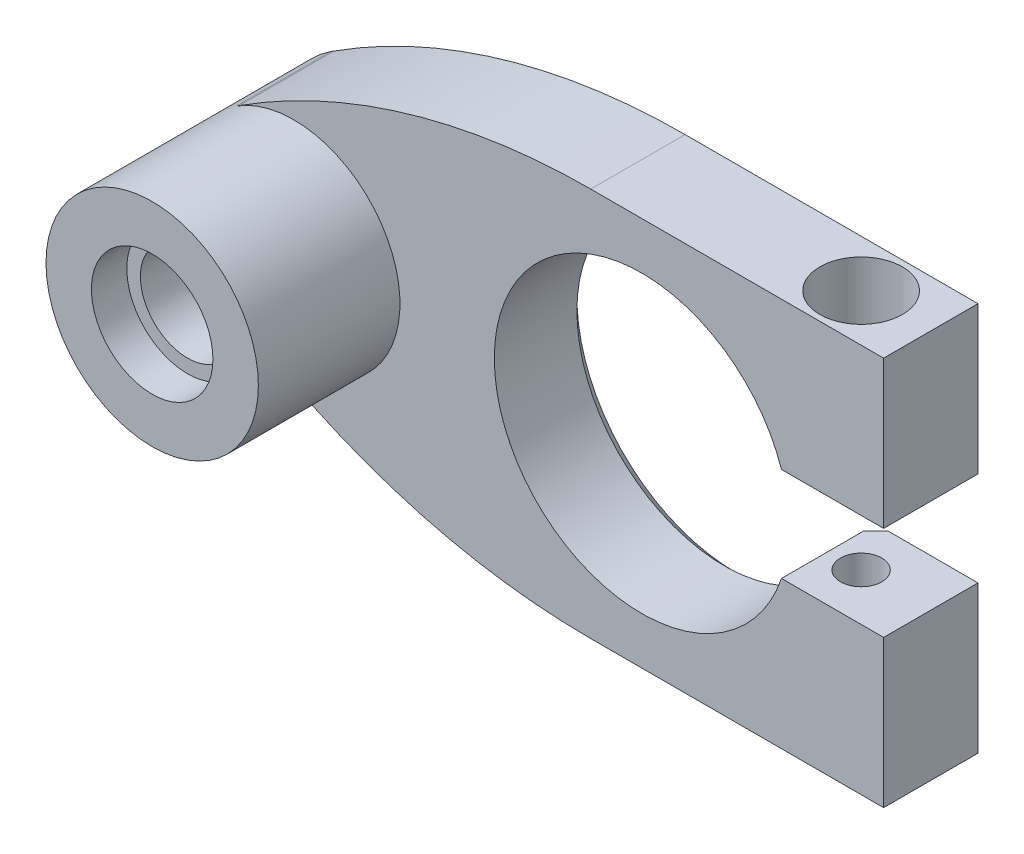
ISO-10303-21;
HEADER;
FILE_DESCRIPTION(('STEP AP214'),'2;1');
FILE_NAME('part.step','',(''),(''),'','','');
FILE_SCHEMA(('AUTOMOTIVE_DESIGN { 1 0 10303 214 1 1 1 1 }'));
ENDSEC;
DATA;
#1=APPLICATION_CONTEXT('core data for automotive mechanical design processes');
#2=APPLICATION_PROTOCOL_DEFINITION('international standard','automotive_design',2000,#1);
#3=PRODUCT_CONTEXT('',#1,'mechanical');
#4=PRODUCT('Part','Part','',(#3));
#5=PRODUCT_RELATED_PRODUCT_CATEGORY('part','',(#4));
#6=PRODUCT_DEFINITION_FORMATION('','',#4);
#7=PRODUCT_DEFINITION_CONTEXT('part definition',#1,'design');
#8=PRODUCT_DEFINITION('design','',#6,#7);
#9=PRODUCT_DEFINITION_SHAPE('','',#8);
#10=(LENGTH_UNIT() NAMED_UNIT(*) SI_UNIT(.MILLI.,.METRE.));
#11=(NAMED_UNIT(*) PLANE_ANGLE_UNIT() SI_UNIT($,.RADIAN.));
#12=(NAMED_UNIT(*) SI_UNIT($,.STERADIAN.) SOLID_ANGLE_UNIT());
#13=UNCERTAINTY_MEASURE_WITH_UNIT(LENGTH_MEASURE(1.E-05),#10,'distance_accuracy_value','');
#14=(GEOMETRIC_REPRESENTATION_CONTEXT(3) GLOBAL_UNCERTAINTY_ASSIGNED_CONTEXT((#13)) GLOBAL_UNIT_ASSIGNED_CONTEXT((#10,
#11,#12)) REPRESENTATION_CONTEXT('',''));
#15=CARTESIAN_POINT('',(0.,0.,0.));
#16=DIRECTION('',(0.,0.,1.));
#17=DIRECTION('',(1.,0.,0.));
#18=AXIS2_PLACEMENT_3D('',#15,#16,#17);
#19=CARTESIAN_POINT('',(14.592719282327,16.5,4.));
#20=DIRECTION('',(0.,-1.,0.));
#21=DIRECTION('',(0.,0.,-1.));
#22=AXIS2_PLACEMENT_3D('',#19,#20,#21);
#23=CYLINDRICAL_SURFACE('',#22,1.75);
#24=CARTESIAN_POINT('',(14.592719282327,4.,4.));
#25=DIRECTION('',(0.,1.,0.));
#26=DIRECTION('',(0.,0.,1.));
#27=AXIS2_PLACEMENT_3D('',#24,#25,#26);
#28=CIRCLE('',#27,1.75);
#29=CARTESIAN_POINT('',(14.592719282327,4.,5.75));
#30=VERTEX_POINT('',#29);
#31=EDGE_CURVE('E230',#30,#30,#28,.T.);
#32=ORIENTED_EDGE('',*,*,#31,.F.);
#33=EDGE_LOOP('',(#32));
#34=FACE_BOUND('',#33,.T.);
#35=CARTESIAN_POINT('',(14.592719282327,11.5,4.));
#36=DIRECTION('',(0.,1.,0.));
#37=DIRECTION('',(0.,0.,1.));
#38=AXIS2_PLACEMENT_3D('',#35,#36,#37);
#39=CIRCLE('',#38,1.75);
#40=CARTESIAN_POINT('',(14.592719282327,11.5,5.75));
#41=VERTEX_POINT('',#40);
#42=EDGE_CURVE('E210',#41,#41,#39,.F.);
#43=ORIENTED_EDGE('',*,*,#42,.F.);
#44=EDGE_LOOP('',(#43));
#45=FACE_BOUND('',#44,.T.);
#46=ADVANCED_FACE('F34',(#34,#45),#23,.F.);
#47=CARTESIAN_POINT('',(14.592719282327,-4.,4.));
#48=DIRECTION('',(0.,-1.,0.));
#49=DIRECTION('',(0.,0.,-1.));
#50=AXIS2_PLACEMENT_3D('',#47,#48,#49);
#51=CIRCLE('',#50,1.75);
#52=CARTESIAN_POINT('',(14.592719282327,-4.,2.25));
#53=VERTEX_POINT('',#52);
#54=EDGE_CURVE('E233',#53,#53,#51,.T.);
#55=ORIENTED_EDGE('',*,*,#54,.F.);
#56=EDGE_LOOP('',(#55));
#57=FACE_BOUND('',#56,.T.);
#58=CARTESIAN_POINT('',(14.592719282327,-9.5,4.));
#59=DIRECTION('',(0.,-1.,0.));
#60=DIRECTION('',(0.,0.,-1.));
#61=AXIS2_PLACEMENT_3D('',#58,#59,#60);
#62=CIRCLE('',#61,1.75);
#63=CARTESIAN_POINT('',(14.592719282327,-9.5,2.25));
#64=VERTEX_POINT('',#63);
#65=EDGE_CURVE('E222',#64,#64,#62,.F.);
#66=ORIENTED_EDGE('',*,*,#65,.F.);
#67=EDGE_LOOP('',(#66));
#68=FACE_BOUND('',#67,.T.);
#69=ADVANCED_FACE('F392',(#57,#68),#23,.F.);
#70=CARTESIAN_POINT('',(-29.5,0.,20.));
#71=DIRECTION('',(0.,0.,-1.));
#72=DIRECTION('',(-1.,0.,0.));
#73=AXIS2_PLACEMENT_3D('',#70,#71,#72);
#74=CYLINDRICAL_SURFACE('',#73,4.);
#75=CARTESIAN_POINT('',(-29.5,0.,3.));
#76=DIRECTION('',(0.,0.,1.));
#77=DIRECTION('',(1.,0.,0.));
#78=AXIS2_PLACEMENT_3D('',#75,#76,#77);
#79=CIRCLE('',#78,4.);
#80=CARTESIAN_POINT('',(-25.5,0.,3.));
#81=VERTEX_POINT('',#80);
#82=EDGE_CURVE('E239',#81,#81,#79,.T.);
#83=ORIENTED_EDGE('',*,*,#82,.F.);
#84=EDGE_LOOP('',(#83));
#85=FACE_BOUND('',#84,.T.);
#86=CARTESIAN_POINT('',(-29.5,0.,17.));
#87=DIRECTION('',(0.,0.,1.));
#88=DIRECTION('',(1.,0.,0.));
#89=AXIS2_PLACEMENT_3D('',#86,#87,#88);
#90=CIRCLE('',#89,4.);
#91=CARTESIAN_POINT('',(-25.5,0.,17.));
#92=VERTEX_POINT('',#91);
#93=EDGE_CURVE('E243',#92,#92,#90,.T.);
#94=ORIENTED_EDGE('',*,*,#93,.T.);
#95=EDGE_LOOP('',(#94));
#96=FACE_BOUND('',#95,.T.);
#97=ADVANCED_FACE('F398',(#85,#96),#74,.F.);
#98=CARTESIAN_POINT('',(-29.5,0.,20.));
#99=DIRECTION('',(0.,0.,1.));
#100=DIRECTION('',(1.,0.,0.));
#101=AXIS2_PLACEMENT_3D('',#98,#99,#100);
#102=PLANE('',#101);
#103=CARTESIAN_POINT('',(-29.5,0.,20.));
#104=DIRECTION('',(0.,0.,1.));
#105=DIRECTION('',(1.,0.,0.));
#106=AXIS2_PLACEMENT_3D('',#103,#104,#105);
#107=CIRCLE('',#106,5.15);
#108=CARTESIAN_POINT('',(-24.35,0.,20.));
#109=VERTEX_POINT('',#108);
#110=EDGE_CURVE('E244',#109,#109,#107,.T.);
#111=ORIENTED_EDGE('',*,*,#110,.F.);
#112=EDGE_LOOP('',(#111));
#113=FACE_BOUND('',#112,.T.);
#114=CARTESIAN_POINT('',(-29.5,0.,20.));
#115=DIRECTION('',(0.,0.,1.));
#116=DIRECTION('',(1.,0.,0.));
#117=AXIS2_PLACEMENT_3D('',#114,#115,#116);
#118=CIRCLE('',#117,9.00000000000001);
#119=CARTESIAN_POINT('',(-20.5,0.,20.));
#120=VERTEX_POINT('',#119);
#121=EDGE_CURVE('E269',#120,#120,#118,.T.);
#122=ORIENTED_EDGE('',*,*,#121,.T.);
#123=EDGE_LOOP('',(#122));
#124=FACE_BOUND('',#123,.T.);
#125=ADVANCED_FACE('F430',(#113,#124),#102,.T.);
#126=CARTESIAN_POINT('',(20.5,-4.,20.));
#127=DIRECTION('',(-1.,0.,0.));
#128=DIRECTION('',(0.,0.,1.));
#129=AXIS2_PLACEMENT_3D('',#126,#127,#128);
#130=PLANE('',#129);
#131=DIRECTION('',(0.,1.,0.));
#132=VECTOR('',#131,1.);
#133=CARTESIAN_POINT('',(20.5,-4.,8.));
#134=LINE('',#133,#132);
#135=CARTESIAN_POINT('',(20.5,-16.5,8.));
#136=VERTEX_POINT('',#135);
#137=CARTESIAN_POINT('',(20.5,-4.,8.));
#138=VERTEX_POINT('',#137);
#139=EDGE_CURVE('E253',#136,#138,#134,.T.);
#140=ORIENTED_EDGE('',*,*,#139,.F.);
#141=DIRECTION('',(0.,0.,-1.));
#142=VECTOR('',#141,1.);
#143=CARTESIAN_POINT('',(20.5,-16.5,20.));
#144=LINE('',#143,#142);
#145=CARTESIAN_POINT('',(20.5,-16.5,0.));
#146=VERTEX_POINT('',#145);
#147=EDGE_CURVE('E272',#136,#146,#144,.T.);
#148=ORIENTED_EDGE('',*,*,#147,.T.);
#149=DIRECTION('',(0.,1.,0.));
#150=VECTOR('',#149,1.);
#151=CARTESIAN_POINT('',(20.5,-4.,0.));
#152=LINE('',#151,#150);
#153=CARTESIAN_POINT('',(20.5,-4.,0.));
#154=VERTEX_POINT('',#153);
#155=EDGE_CURVE('E268',#146,#154,#152,.T.);
#156=ORIENTED_EDGE('',*,*,#155,.T.);
#157=DIRECTION('',(0.,0.,-1.));
#158=VECTOR('',#157,1.);
#159=CARTESIAN_POINT('',(20.5,-4.,20.));
#160=LINE('',#159,#158);
#161=EDGE_CURVE('E312',#138,#154,#160,.T.);
#162=ORIENTED_EDGE('',*,*,#161,.F.);
#163=EDGE_LOOP('',(#140,#148,#156,#162));
#164=FACE_BOUND('',#163,.T.);
#165=ADVANCED_FACE('F372',(#164),#130,.F.);
#166=CARTESIAN_POINT('',(20.5,-4.,20.));
#167=DIRECTION('',(0.,-1.,0.));
#168=DIRECTION('',(0.,0.,-1.));
#169=AXIS2_PLACEMENT_3D('',#166,#167,#168);
#170=PLANE('',#169);
#171=ORIENTED_EDGE('',*,*,#54,.T.);
#172=EDGE_LOOP('',(#171));
#173=FACE_BOUND('',#172,.T.);
#174=DIRECTION('',(-1.,0.,0.));
#175=VECTOR('',#174,1.);
#176=CARTESIAN_POINT('',(20.5,-4.,0.));
#177=LINE('',#176,#175);
#178=CARTESIAN_POINT('',(12.8937969582276,-4.,0.));
#179=VERTEX_POINT('',#178);
#180=EDGE_CURVE('E276',#154,#179,#177,.T.);
#181=ORIENTED_EDGE('',*,*,#180,.T.);
#182=CARTESIAN_POINT('',(12.8937969582276,-4.,0.));
#183=CARTESIAN_POINT('',(12.7189527197675,-4.,0.167019157332451));
#184=CARTESIAN_POINT('',(12.5439407976292,-4.,0.333862066094261));
#185=CARTESIAN_POINT('',(12.1935815723551,-4.,0.667195399455045));
#186=CARTESIAN_POINT('',(12.0182342691932,-4.,0.83368582402657));
#187=CARTESIAN_POINT('',(11.842719282327,-4.,1.00000000000001));
#188=B_SPLINE_CURVE_WITH_KNOTS('',3,(#182,#183,#184,#185,#186,#187),.UNSPECIFIED.,.F.,.F.,(4,2,
4),(0.,0.725390627077384,1.45078131064144),.UNSPECIFIED.);
#189=CARTESIAN_POINT('',(11.842719282327,-4.00000000000001,1.));
#190=VERTEX_POINT('',#189);
#191=EDGE_CURVE('E42',#179,#190,#188,.T.);
#192=ORIENTED_EDGE('',*,*,#191,.T.);
#193=DIRECTION('',(0.,0.,-1.));
#194=VECTOR('',#193,1.);
#195=CARTESIAN_POINT('',(11.842719282327,-4.00000000000001,20.));
#196=LINE('',#195,#194);
#197=CARTESIAN_POINT('',(11.842719282327,-4.,8.));
#198=VERTEX_POINT('',#197);
#199=EDGE_CURVE('E309',#198,#190,#196,.T.);
#200=ORIENTED_EDGE('',*,*,#199,.F.);
#201=DIRECTION('',(-1.,0.,0.));
#202=VECTOR('',#201,1.);
#203=CARTESIAN_POINT('',(20.5,-4.,8.));
#204=LINE('',#203,#202);
#205=EDGE_CURVE('E255',#138,#198,#204,.T.);
#206=ORIENTED_EDGE('',*,*,#205,.F.);
#207=ORIENTED_EDGE('',*,*,#161,.T.);
#208=EDGE_LOOP('',(#181,#192,#200,#206,#207));
#209=FACE_BOUND('',#208,.T.);
#210=ADVANCED_FACE('F367',(#173,#209),#170,.F.);
#211=CARTESIAN_POINT('',(0.,0.,20.));
#212=DIRECTION('',(0.,0.,-1.));
#213=DIRECTION('',(-1.,0.,0.));
#214=AXIS2_PLACEMENT_3D('',#211,#212,#213);
#215=CYLINDRICAL_SURFACE('',#214,12.5);
#216=ORIENTED_EDGE('',*,*,#199,.T.);
#217=CARTESIAN_POINT('',(0.,0.,1.));
#218=DIRECTION('',(0.,0.,1.));
#219=DIRECTION('',(1.,0.,0.));
#220=AXIS2_PLACEMENT_3D('',#217,#218,#219);
#221=CIRCLE('',#220,12.5);
#222=CARTESIAN_POINT('',(11.842719282327,4.,1.));
#223=VERTEX_POINT('',#222);
#224=EDGE_CURVE('E334',#190,#223,#221,.F.);
#225=ORIENTED_EDGE('',*,*,#224,.T.);
#226=DIRECTION('',(0.,0.,-1.));
#227=VECTOR('',#226,1.);
#228=CARTESIAN_POINT('',(11.842719282327,4.,20.));
#229=LINE('',#228,#227);
#230=CARTESIAN_POINT('',(11.842719282327,4.,8.));
#231=VERTEX_POINT('',#230);
#232=EDGE_CURVE('E307',#231,#223,#229,.T.);
#233=ORIENTED_EDGE('',*,*,#232,.F.);
#234=CARTESIAN_POINT('',(0.,0.,8.));
#235=DIRECTION('',(0.,0.,1.));
#236=DIRECTION('',(1.,0.,0.));
#237=AXIS2_PLACEMENT_3D('',#234,#235,#236);
#238=CIRCLE('',#237,12.5);
#239=EDGE_CURVE('E257',#198,#231,#238,.F.);
#240=ORIENTED_EDGE('',*,*,#239,.F.);
#241=EDGE_LOOP('',(#216,#225,#233,#240));
#242=FACE_BOUND('',#241,.T.);
#243=ADVANCED_FACE('F362',(#242),#215,.F.);
#244=CARTESIAN_POINT('',(20.5,4.,20.));
#245=DIRECTION('',(0.,1.,0.));
#246=DIRECTION('',(0.,0.,1.));
#247=AXIS2_PLACEMENT_3D('',#244,#245,#246);
#248=PLANE('',#247);
#249=ORIENTED_EDGE('',*,*,#31,.T.);
#250=EDGE_LOOP('',(#249));
#251=FACE_BOUND('',#250,.T.);
#252=ORIENTED_EDGE('',*,*,#232,.T.);
#253=CARTESIAN_POINT('',(11.842719282327,4.,1.));
#254=CARTESIAN_POINT('',(12.0182342691932,4.,0.83368582402657));
#255=CARTESIAN_POINT('',(12.1935815723551,4.,0.667195399455045));
#256=CARTESIAN_POINT('',(12.5439407976292,4.,0.333862066094261));
#257=CARTESIAN_POINT('',(12.7189527197675,4.,0.167019157332452));
#258=CARTESIAN_POINT('',(12.8937969582276,4.,0.));
#259=B_SPLINE_CURVE_WITH_KNOTS('',3,(#253,#254,#255,#256,#257,#258),.UNSPECIFIED.,.F.,.F.,(4,2,
4),(0.,0.725390683564053,1.45078131064144),.UNSPECIFIED.);
#260=CARTESIAN_POINT('',(12.8937969582276,4.,0.));
#261=VERTEX_POINT('',#260);
#262=EDGE_CURVE('E57',#223,#261,#259,.T.);
#263=ORIENTED_EDGE('',*,*,#262,.T.);
#264=DIRECTION('',(1.,0.,0.));
#265=VECTOR('',#264,1.);
#266=CARTESIAN_POINT('',(20.5,4.,0.));
#267=LINE('',#266,#265);
#268=CARTESIAN_POINT('',(20.5,4.,0.));
#269=VERTEX_POINT('',#268);
#270=EDGE_CURVE('E278',#261,#269,#267,.T.);
#271=ORIENTED_EDGE('',*,*,#270,.T.);
#272=DIRECTION('',(0.,0.,-1.));
#273=VECTOR('',#272,1.);
#274=CARTESIAN_POINT('',(20.5,4.,20.));
#275=LINE('',#274,#273);
#276=CARTESIAN_POINT('',(20.5,4.,8.));
#277=VERTEX_POINT('',#276);
#278=EDGE_CURVE('E304',#277,#269,#275,.T.);
#279=ORIENTED_EDGE('',*,*,#278,.F.);
#280=DIRECTION('',(1.,0.,0.));
#281=VECTOR('',#280,1.);
#282=CARTESIAN_POINT('',(20.5,4.,8.));
#283=LINE('',#282,#281);
#284=EDGE_CURVE('E259',#231,#277,#283,.T.);
#285=ORIENTED_EDGE('',*,*,#284,.F.);
#286=EDGE_LOOP('',(#252,#263,#271,#279,#285));
#287=FACE_BOUND('',#286,.T.);
#288=ADVANCED_FACE('F356',(#251,#287),#248,.F.);
#289=CARTESIAN_POINT('',(20.5,16.5,20.));
#290=DIRECTION('',(-1.,0.,0.));
#291=DIRECTION('',(0.,0.,1.));
#292=AXIS2_PLACEMENT_3D('',#289,#290,#291);
#293=PLANE('',#292);
#294=DIRECTION('',(0.,1.,0.));
#295=VECTOR('',#294,1.);
#296=CARTESIAN_POINT('',(20.5,16.5,8.));
#297=LINE('',#296,#295);
#298=CARTESIAN_POINT('',(20.5,16.5,8.));
#299=VERTEX_POINT('',#298);
#300=EDGE_CURVE('E261',#277,#299,#297,.T.);
#301=ORIENTED_EDGE('',*,*,#300,.F.);
#302=ORIENTED_EDGE('',*,*,#278,.T.);
#303=DIRECTION('',(0.,1.,0.));
#304=VECTOR('',#303,1.);
#305=CARTESIAN_POINT('',(20.5,16.5,0.));
#306=LINE('',#305,#304);
#307=CARTESIAN_POINT('',(20.5,16.5,0.));
#308=VERTEX_POINT('',#307);
#309=EDGE_CURVE('E280',#269,#308,#306,.T.);
#310=ORIENTED_EDGE('',*,*,#309,.T.);
#311=DIRECTION('',(0.,0.,-1.));
#312=VECTOR('',#311,1.);
#313=CARTESIAN_POINT('',(20.5,16.5,20.));
#314=LINE('',#313,#312);
#315=EDGE_CURVE('E302',#299,#308,#314,.T.);
#316=ORIENTED_EDGE('',*,*,#315,.F.);
#317=EDGE_LOOP('',(#301,#302,#310,#316));
#318=FACE_BOUND('',#317,.T.);
#319=ADVANCED_FACE('F361',(#318),#293,.F.);
#320=CARTESIAN_POINT('',(-20.5,16.5,20.));
#321=DIRECTION('',(0.,-1.,0.));
#322=DIRECTION('',(0.,0.,-1.));
#323=AXIS2_PLACEMENT_3D('',#320,#321,#322);
#324=PLANE('',#323);
#325=CARTESIAN_POINT('',(14.592719282327,16.5,4.));
#326=DIRECTION('',(0.,1.,0.));
#327=DIRECTION('',(0.,0.,1.));
#328=AXIS2_PLACEMENT_3D('',#325,#326,#327);
#329=CIRCLE('',#328,3.5);
#330=CARTESIAN_POINT('',(14.592719282327,16.5,7.5));
#331=VERTEX_POINT('',#330);
#332=EDGE_CURVE('E198',#331,#331,#329,.T.);
#333=ORIENTED_EDGE('',*,*,#332,.F.);
#334=EDGE_LOOP('',(#333));
#335=FACE_BOUND('',#334,.T.);
#336=DIRECTION('',(-1.,0.,0.));
#337=VECTOR('',#336,1.);
#338=CARTESIAN_POINT('',(-20.5,16.5,0.));
#339=LINE('',#338,#337);
#340=CARTESIAN_POINT('',(-4.32352941176473,16.5,0.));
#341=VERTEX_POINT('',#340);
#342=EDGE_CURVE('E283',#308,#341,#339,.T.);
#343=ORIENTED_EDGE('',*,*,#342,.T.);
#344=DIRECTION('',(0.,0.,-1.));
#345=VECTOR('',#344,1.);
#346=CARTESIAN_POINT('',(-4.32352941176473,16.5,20.));
#347=LINE('',#346,#345);
#348=CARTESIAN_POINT('',(-4.32352941176473,16.5,8.));
#349=VERTEX_POINT('',#348);
#350=EDGE_CURVE('E332',#341,#349,#347,.F.);
#351=ORIENTED_EDGE('',*,*,#350,.T.);
#352=DIRECTION('',(-1.,0.,0.));
#353=VECTOR('',#352,1.);
#354=CARTESIAN_POINT('',(-20.5,16.5,8.));
#355=LINE('',#354,#353);
#356=EDGE_CURVE('E263',#299,#349,#355,.T.);
#357=ORIENTED_EDGE('',*,*,#356,.F.);
#358=ORIENTED_EDGE('',*,*,#315,.T.);
#359=EDGE_LOOP('',(#343,#351,#357,#358));
#360=FACE_BOUND('',#359,.T.);
#361=ADVANCED_FACE('F450',(#335,#360),#324,.F.);
#362=CARTESIAN_POINT('',(-20.5,16.5,20.));
#363=DIRECTION('',(0.54140127388535,-0.840764331210191,0.));
#364=DIRECTION('',(0.840764331210191,0.54140127388535,0.));
#365=AXIS2_PLACEMENT_3D('',#362,#363,#364);
#366=PLANE('',#365);
#367=DIRECTION('',(-0.840764331210191,-0.54140127388535,0.));
#368=VECTOR('',#367,1.);
#369=CARTESIAN_POINT('',(-20.5,16.5,8.));
#370=LINE('',#369,#368);
#371=CARTESIAN_POINT('',(-34.100599475459,7.74203821656051,8.));
#372=VERTEX_POINT('',#371);
#373=CARTESIAN_POINT('',(-34.3726114649682,7.56687898089172,8.));
#374=VERTEX_POINT('',#373);
#375=EDGE_CURVE('E266',#372,#374,#370,.T.);
#376=ORIENTED_EDGE('',*,*,#375,.F.);
#377=DIRECTION('',(0.,0.,-1.));
#378=VECTOR('',#377,1.);
#379=CARTESIAN_POINT('',(-34.100599475459,7.74203821656051,20.));
#380=LINE('',#379,#378);
#381=CARTESIAN_POINT('',(-34.100599475459,7.74203821656051,0.));
#382=VERTEX_POINT('',#381);
#383=EDGE_CURVE('E329',#372,#382,#380,.T.);
#384=ORIENTED_EDGE('',*,*,#383,.T.);
#385=DIRECTION('',(-0.840764331210191,-0.54140127388535,0.));
#386=VECTOR('',#385,1.);
#387=CARTESIAN_POINT('',(-20.5,16.5,0.));
#388=LINE('',#387,#386);
#389=CARTESIAN_POINT('',(-34.3726114649682,7.56687898089172,0.));
#390=VERTEX_POINT('',#389);
#391=EDGE_CURVE('E286',#382,#390,#388,.T.);
#392=ORIENTED_EDGE('',*,*,#391,.T.);
#393=DIRECTION('',(0.,0.,-1.));
#394=VECTOR('',#393,1.);
#395=CARTESIAN_POINT('',(-34.3726114649682,7.56687898089172,20.));
#396=LINE('',#395,#394);
#397=EDGE_CURVE('E299',#374,#390,#396,.T.);
#398=ORIENTED_EDGE('',*,*,#397,.F.);
#399=EDGE_LOOP('',(#376,#384,#392,#398));
#400=FACE_BOUND('',#399,.T.);
#401=ADVANCED_FACE('F444',(#400),#366,.F.);
#402=CARTESIAN_POINT('',(-20.5,-16.5,20.));
#403=DIRECTION('',(0.54140127388535,0.840764331210191,0.));
#404=DIRECTION('',(-0.840764331210191,0.54140127388535,0.));
#405=AXIS2_PLACEMENT_3D('',#402,#403,#404);
#406=PLANE('',#405);
#407=DIRECTION('',(0.840764331210191,-0.54140127388535,0.));
#408=VECTOR('',#407,1.);
#409=CARTESIAN_POINT('',(-20.5,-16.5,0.));
#410=LINE('',#409,#408);
#411=CARTESIAN_POINT('',(-34.3726114649682,-7.56687898089172,0.));
#412=VERTEX_POINT('',#411);
#413=CARTESIAN_POINT('',(-34.100599475459,-7.74203821656051,0.));
#414=VERTEX_POINT('',#413);
#415=EDGE_CURVE('E291',#412,#414,#410,.T.);
#416=ORIENTED_EDGE('',*,*,#415,.T.);
#417=DIRECTION('',(0.,0.,-1.));
#418=VECTOR('',#417,1.);
#419=CARTESIAN_POINT('',(-34.100599475459,-7.74203821656051,20.));
#420=LINE('',#419,#418);
#421=CARTESIAN_POINT('',(-34.100599475459,-7.74203821656051,8.));
#422=VERTEX_POINT('',#421);
#423=EDGE_CURVE('E323',#414,#422,#420,.F.);
#424=ORIENTED_EDGE('',*,*,#423,.T.);
#425=DIRECTION('',(0.840764331210191,-0.54140127388535,0.));
#426=VECTOR('',#425,1.);
#427=CARTESIAN_POINT('',(-20.5,-16.5,8.));
#428=LINE('',#427,#426);
#429=CARTESIAN_POINT('',(-34.3726114649682,-7.56687898089172,8.));
#430=VERTEX_POINT('',#429);
#431=EDGE_CURVE('E250',#430,#422,#428,.T.);
#432=ORIENTED_EDGE('',*,*,#431,.F.);
#433=DIRECTION('',(0.,0.,-1.));
#434=VECTOR('',#433,1.);
#435=CARTESIAN_POINT('',(-34.3726114649682,-7.56687898089172,20.));
#436=LINE('',#435,#434);
#437=EDGE_CURVE('E297',#430,#412,#436,.T.);
#438=ORIENTED_EDGE('',*,*,#437,.T.);
#439=EDGE_LOOP('',(#416,#424,#432,#438));
#440=FACE_BOUND('',#439,.T.);
#441=ADVANCED_FACE('F440',(#440),#406,.F.);
#442=CARTESIAN_POINT('',(-20.5,-16.5,20.));
#443=DIRECTION('',(0.,1.,0.));
#444=DIRECTION('',(0.,0.,1.));
#445=AXIS2_PLACEMENT_3D('',#442,#443,#444);
#446=PLANE('',#445);
#447=DIRECTION('',(-0.866025403784438,0.,-0.500000000000001));
#448=VECTOR('',#447,1.);
#449=CARTESIAN_POINT('',(14.592719282327,-16.5,7.2331615074619));
#450=LINE('',#449,#448);
#451=CARTESIAN_POINT('',(14.592719282327,-16.5,7.2331615074619));
#452=VERTEX_POINT('',#451);
#453=CARTESIAN_POINT('',(11.792719282327,-16.5,5.61658075373095));
#454=VERTEX_POINT('',#453);
#455=EDGE_CURVE('E209',#452,#454,#450,.T.);
#456=ORIENTED_EDGE('',*,*,#455,.F.);
#457=DIRECTION('',(-0.866025403784439,0.,0.499999999999999));
#458=VECTOR('',#457,1.);
#459=CARTESIAN_POINT('',(17.392719282327,-16.5,5.61658075373095));
#460=LINE('',#459,#458);
#461=CARTESIAN_POINT('',(17.392719282327,-16.5,5.61658075373095));
#462=VERTEX_POINT('',#461);
#463=EDGE_CURVE('E173',#462,#452,#460,.T.);
#464=ORIENTED_EDGE('',*,*,#463,.F.);
#465=DIRECTION('',(0.,0.,1.));
#466=VECTOR('',#465,1.);
#467=CARTESIAN_POINT('',(17.392719282327,-16.5,2.38341924626904));
#468=LINE('',#467,#466);
#469=CARTESIAN_POINT('',(17.392719282327,-16.5,2.38341924626904));
#470=VERTEX_POINT('',#469);
#471=EDGE_CURVE('E192',#470,#462,#468,.T.);
#472=ORIENTED_EDGE('',*,*,#471,.F.);
#473=DIRECTION('',(0.866025403784438,0.,0.5));
#474=VECTOR('',#473,1.);
#475=CARTESIAN_POINT('',(14.592719282327,-16.5,0.766838492538091));
#476=LINE('',#475,#474);
#477=CARTESIAN_POINT('',(14.592719282327,-16.5,0.766838492538091));
#478=VERTEX_POINT('',#477);
#479=EDGE_CURVE('E195',#478,#470,#476,.T.);
#480=ORIENTED_EDGE('',*,*,#479,.F.);
#481=DIRECTION('',(0.866025403784439,0.,-0.499999999999999));
#482=VECTOR('',#481,1.);
#483=CARTESIAN_POINT('',(11.792719282327,-16.5,2.38341924626904));
#484=LINE('',#483,#482);
#485=CARTESIAN_POINT('',(11.792719282327,-16.5,2.38341924626904));
#486=VERTEX_POINT('',#485);
#487=EDGE_CURVE('E215',#486,#478,#484,.T.);
#488=ORIENTED_EDGE('',*,*,#487,.F.);
#489=DIRECTION('',(0.,0.,-1.));
#490=VECTOR('',#489,1.);
#491=CARTESIAN_POINT('',(11.792719282327,-16.5,5.61658075373095));
#492=LINE('',#491,#490);
#493=EDGE_CURVE('E212',#454,#486,#492,.T.);
#494=ORIENTED_EDGE('',*,*,#493,.F.);
#495=EDGE_LOOP('',(#456,#464,#472,#480,#488,#494));
#496=FACE_BOUND('',#495,.T.);
#497=DIRECTION('',(1.,0.,0.));
#498=VECTOR('',#497,1.);
#499=CARTESIAN_POINT('',(-20.5,-16.5,8.));
#500=LINE('',#499,#498);
#501=CARTESIAN_POINT('',(-4.32352941176472,-16.5,8.));
#502=VERTEX_POINT('',#501);
#503=EDGE_CURVE('E314',#502,#136,#500,.T.);
#504=ORIENTED_EDGE('',*,*,#503,.F.);
#505=DIRECTION('',(0.,0.,-1.));
#506=VECTOR('',#505,1.);
#507=CARTESIAN_POINT('',(-4.32352941176472,-16.5,20.));
#508=LINE('',#507,#506);
#509=CARTESIAN_POINT('',(-4.32352941176473,-16.5,0.));
#510=VERTEX_POINT('',#509);
#511=EDGE_CURVE('E316',#502,#510,#508,.T.);
#512=ORIENTED_EDGE('',*,*,#511,.T.);
#513=DIRECTION('',(1.,0.,0.));
#514=VECTOR('',#513,1.);
#515=CARTESIAN_POINT('',(-20.5,-16.5,0.));
#516=LINE('',#515,#514);
#517=EDGE_CURVE('E273',#510,#146,#516,.T.);
#518=ORIENTED_EDGE('',*,*,#517,.T.);
#519=ORIENTED_EDGE('',*,*,#147,.F.);
#520=EDGE_LOOP('',(#504,#512,#518,#519));
#521=FACE_BOUND('',#520,.T.);
#522=ADVANCED_FACE('F437',(#496,#521),#446,.F.);
#523=CARTESIAN_POINT('',(-29.5,0.,0.));
#524=DIRECTION('',(0.,0.,1.));
#525=DIRECTION('',(1.,0.,0.));
#526=AXIS2_PLACEMENT_3D('',#523,#524,#525);
#527=PLANE('',#526);
#528=CARTESIAN_POINT('',(-29.5,0.,0.));
#529=DIRECTION('',(0.,0.,1.));
#530=DIRECTION('',(1.,0.,0.));
#531=AXIS2_PLACEMENT_3D('',#528,#529,#530);
#532=CIRCLE('',#531,6.14999999999999);
#533=CARTESIAN_POINT('',(-23.35,0.,0.));
#534=VERTEX_POINT('',#533);
#535=EDGE_CURVE('E351',#534,#534,#532,.T.);
#536=ORIENTED_EDGE('',*,*,#535,.T.);
#537=EDGE_LOOP('',(#536));
#538=FACE_BOUND('',#537,.T.);
#539=ORIENTED_EDGE('',*,*,#270,.F.);
#540=CARTESIAN_POINT('',(0.,0.,0.));
#541=DIRECTION('',(0.,0.,1.));
#542=DIRECTION('',(1.,0.,0.));
#543=AXIS2_PLACEMENT_3D('',#540,#541,#542);
#544=CIRCLE('',#543,13.5);
#545=EDGE_CURVE('E49',#261,#179,#544,.T.);
#546=ORIENTED_EDGE('',*,*,#545,.T.);
#547=ORIENTED_EDGE('',*,*,#180,.F.);
#548=ORIENTED_EDGE('',*,*,#155,.F.);
#549=ORIENTED_EDGE('',*,*,#517,.F.);
#550=CARTESIAN_POINT('',(-4.32352941176472,38.5,0.));
#551=DIRECTION('',(0.,0.,1.));
#552=DIRECTION('',(1.,0.,0.));
#553=AXIS2_PLACEMENT_3D('',#550,#551,#552);
#554=CIRCLE('',#553,55.);
#555=EDGE_CURVE('E321',#510,#414,#554,.F.);
#556=ORIENTED_EDGE('',*,*,#555,.T.);
#557=ORIENTED_EDGE('',*,*,#415,.F.);
#558=CARTESIAN_POINT('',(-29.5,0.,0.));
#559=DIRECTION('',(0.,0.,1.));
#560=DIRECTION('',(1.,0.,0.));
#561=AXIS2_PLACEMENT_3D('',#558,#559,#560);
#562=CIRCLE('',#561,9.00000000000001);
#563=EDGE_CURVE('E288',#390,#412,#562,.T.);
#564=ORIENTED_EDGE('',*,*,#563,.F.);
#565=ORIENTED_EDGE('',*,*,#391,.F.);
#566=CARTESIAN_POINT('',(-4.32352941176473,-38.5,0.));
#567=DIRECTION('',(0.,0.,1.));
#568=DIRECTION('',(1.,0.,0.));
#569=AXIS2_PLACEMENT_3D('',#566,#567,#568);
#570=CIRCLE('',#569,55.);
#571=EDGE_CURVE('E319',#382,#341,#570,.F.);
#572=ORIENTED_EDGE('',*,*,#571,.T.);
#573=ORIENTED_EDGE('',*,*,#342,.F.);
#574=ORIENTED_EDGE('',*,*,#309,.F.);
#575=EDGE_LOOP('',(#539,#546,#547,#548,#549,#556,#557,#564,#565,#572,#573,#574));
#576=FACE_BOUND('',#575,.T.);
#577=ADVANCED_FACE('F381',(#538,#576),#527,.F.);
#578=CARTESIAN_POINT('',(-29.5,0.,20.));
#579=DIRECTION('',(0.,0.,-1.));
#580=DIRECTION('',(-1.,0.,0.));
#581=AXIS2_PLACEMENT_3D('',#578,#579,#580);
#582=CYLINDRICAL_SURFACE('',#581,9.00000000000001);
#583=CARTESIAN_POINT('',(-29.5,0.,8.));
#584=DIRECTION('',(0.,0.,1.));
#585=DIRECTION('',(1.,0.,0.));
#586=AXIS2_PLACEMENT_3D('',#583,#584,#585);
#587=CIRCLE('',#586,9.);
#588=EDGE_CURVE('E247',#430,#374,#587,.T.);
#589=ORIENTED_EDGE('',*,*,#588,.T.);
#590=ORIENTED_EDGE('',*,*,#397,.T.);
#591=ORIENTED_EDGE('',*,*,#563,.T.);
#592=ORIENTED_EDGE('',*,*,#437,.F.);
#593=EDGE_LOOP('',(#589,#590,#591,#592));
#594=FACE_BOUND('',#593,.T.);
#595=ORIENTED_EDGE('',*,*,#121,.F.);
#596=EDGE_LOOP('',(#595));
#597=FACE_BOUND('',#596,.T.);
#598=ADVANCED_FACE('F426',(#594,#597),#582,.T.);
#599=CARTESIAN_POINT('',(-9.,0.,8.));
#600=DIRECTION('',(0.,0.,1.));
#601=DIRECTION('',(1.,0.,0.));
#602=AXIS2_PLACEMENT_3D('',#599,#600,#601);
#603=PLANE('',#602);
#604=ORIENTED_EDGE('',*,*,#431,.T.);
#605=CARTESIAN_POINT('',(-4.32352941176472,38.5,8.));
#606=DIRECTION('',(0.,0.,1.));
#607=DIRECTION('',(1.,0.,0.));
#608=AXIS2_PLACEMENT_3D('',#605,#606,#607);
#609=CIRCLE('',#608,55.);
#610=EDGE_CURVE('E327',#422,#502,#609,.T.);
#611=ORIENTED_EDGE('',*,*,#610,.T.);
#612=ORIENTED_EDGE('',*,*,#503,.T.);
#613=ORIENTED_EDGE('',*,*,#139,.T.);
#614=ORIENTED_EDGE('',*,*,#205,.T.);
#615=ORIENTED_EDGE('',*,*,#239,.T.);
#616=ORIENTED_EDGE('',*,*,#284,.T.);
#617=ORIENTED_EDGE('',*,*,#300,.T.);
#618=ORIENTED_EDGE('',*,*,#356,.T.);
#619=CARTESIAN_POINT('',(-4.32352941176473,-38.5,8.));
#620=DIRECTION('',(0.,0.,1.));
#621=DIRECTION('',(1.,0.,0.));
#622=AXIS2_PLACEMENT_3D('',#619,#620,#621);
#623=CIRCLE('',#622,55.);
#624=EDGE_CURVE('E325',#349,#372,#623,.T.);
#625=ORIENTED_EDGE('',*,*,#624,.T.);
#626=ORIENTED_EDGE('',*,*,#375,.T.);
#627=ORIENTED_EDGE('',*,*,#588,.F.);
#628=EDGE_LOOP('',(#604,#611,#612,#613,#614,#615,#616,#617,#618,#625,#626,#627));
#629=FACE_BOUND('',#628,.T.);
#630=ADVANCED_FACE('F422',(#629),#603,.T.);
#631=CARTESIAN_POINT('',(-4.32352941176472,38.5,20.));
#632=DIRECTION('',(0.,0.,-1.));
#633=DIRECTION('',(-1.,0.,0.));
#634=AXIS2_PLACEMENT_3D('',#631,#632,#633);
#635=CYLINDRICAL_SURFACE('',#634,55.);
#636=ORIENTED_EDGE('',*,*,#610,.F.);
#637=ORIENTED_EDGE('',*,*,#423,.F.);
#638=ORIENTED_EDGE('',*,*,#555,.F.);
#639=ORIENTED_EDGE('',*,*,#511,.F.);
#640=EDGE_LOOP('',(#636,#637,#638,#639));
#641=FACE_BOUND('',#640,.T.);
#642=ADVANCED_FACE('F425',(#641),#635,.T.);
#643=CARTESIAN_POINT('',(-4.32352941176473,-38.5,20.));
#644=DIRECTION('',(0.,0.,-1.));
#645=DIRECTION('',(-1.,0.,0.));
#646=AXIS2_PLACEMENT_3D('',#643,#644,#645);
#647=CYLINDRICAL_SURFACE('',#646,55.);
#648=ORIENTED_EDGE('',*,*,#624,.F.);
#649=ORIENTED_EDGE('',*,*,#350,.F.);
#650=ORIENTED_EDGE('',*,*,#571,.F.);
#651=ORIENTED_EDGE('',*,*,#383,.F.);
#652=EDGE_LOOP('',(#648,#649,#650,#651));
#653=FACE_BOUND('',#652,.T.);
#654=ADVANCED_FACE('F420',(#653),#647,.T.);
#655=CARTESIAN_POINT('',(-29.5,0.,17.));
#656=DIRECTION('',(0.,0.,1.));
#657=DIRECTION('',(1.,0.,0.));
#658=AXIS2_PLACEMENT_3D('',#655,#656,#657);
#659=CYLINDRICAL_SURFACE('',#658,5.15);
#660=CARTESIAN_POINT('',(-29.5,0.,17.));
#661=DIRECTION('',(0.,0.,1.));
#662=DIRECTION('',(1.,0.,0.));
#663=AXIS2_PLACEMENT_3D('',#660,#661,#662);
#664=CIRCLE('',#663,5.15);
#665=CARTESIAN_POINT('',(-24.35,0.,17.));
#666=VERTEX_POINT('',#665);
#667=EDGE_CURVE('E240',#666,#666,#664,.T.);
#668=ORIENTED_EDGE('',*,*,#667,.F.);
#669=EDGE_LOOP('',(#668));
#670=FACE_BOUND('',#669,.T.);
#671=ORIENTED_EDGE('',*,*,#110,.T.);
#672=EDGE_LOOP('',(#671));
#673=FACE_BOUND('',#672,.T.);
#674=ADVANCED_FACE('F416',(#670,#673),#659,.F.);
#675=CARTESIAN_POINT('',(-29.5,0.,17.));
#676=DIRECTION('',(0.,0.,1.));
#677=DIRECTION('',(1.,0.,0.));
#678=AXIS2_PLACEMENT_3D('',#675,#676,#677);
#679=PLANE('',#678);
#680=ORIENTED_EDGE('',*,*,#93,.F.);
#681=EDGE_LOOP('',(#680));
#682=FACE_BOUND('',#681,.T.);
#683=ORIENTED_EDGE('',*,*,#667,.T.);
#684=EDGE_LOOP('',(#683));
#685=FACE_BOUND('',#684,.T.);
#686=ADVANCED_FACE('F412',(#682,#685),#679,.T.);
#687=CARTESIAN_POINT('',(-29.5,0.,3.));
#688=DIRECTION('',(0.,0.,-1.));
#689=DIRECTION('',(-1.,0.,0.));
#690=AXIS2_PLACEMENT_3D('',#687,#688,#689);
#691=CYLINDRICAL_SURFACE('',#690,5.15);
#692=CARTESIAN_POINT('',(-29.5,0.,0.999999999999995));
#693=DIRECTION('',(0.,0.,1.));
#694=DIRECTION('',(1.,0.,0.));
#695=AXIS2_PLACEMENT_3D('',#692,#693,#694);
#696=CIRCLE('',#695,5.15);
#697=CARTESIAN_POINT('',(-24.35,0.,0.999999999999995));
#698=VERTEX_POINT('',#697);
#699=EDGE_CURVE('E12',#698,#698,#696,.F.);
#700=ORIENTED_EDGE('',*,*,#699,.T.);
#701=EDGE_LOOP('',(#700));
#702=FACE_BOUND('',#701,.T.);
#703=CARTESIAN_POINT('',(-29.5,0.,3.));
#704=DIRECTION('',(0.,0.,1.));
#705=DIRECTION('',(1.,0.,0.));
#706=AXIS2_PLACEMENT_3D('',#703,#704,#705);
#707=CIRCLE('',#706,5.15);
#708=CARTESIAN_POINT('',(-24.35,0.,3.));
#709=VERTEX_POINT('',#708);
#710=EDGE_CURVE('E236',#709,#709,#707,.T.);
#711=ORIENTED_EDGE('',*,*,#710,.T.);
#712=EDGE_LOOP('',(#711));
#713=FACE_BOUND('',#712,.T.);
#714=ADVANCED_FACE('F408',(#702,#713),#691,.F.);
#715=CARTESIAN_POINT('',(-29.5,0.,3.));
#716=DIRECTION('',(0.,0.,1.));
#717=DIRECTION('',(1.,0.,0.));
#718=AXIS2_PLACEMENT_3D('',#715,#716,#717);
#719=PLANE('',#718);
#720=ORIENTED_EDGE('',*,*,#82,.T.);
#721=EDGE_LOOP('',(#720));
#722=FACE_BOUND('',#721,.T.);
#723=ORIENTED_EDGE('',*,*,#710,.F.);
#724=EDGE_LOOP('',(#723));
#725=FACE_BOUND('',#724,.T.);
#726=ADVANCED_FACE('F405',(#722,#725),#719,.F.);
#727=CARTESIAN_POINT('',(0.,-9.5,0.));
#728=DIRECTION('',(0.,-1.,0.));
#729=DIRECTION('',(0.,0.,-1.));
#730=AXIS2_PLACEMENT_3D('',#727,#728,#729);
#731=PLANE('',#730);
#732=DIRECTION('',(-0.866025403784439,0.,0.499999999999999));
#733=VECTOR('',#732,1.);
#734=CARTESIAN_POINT('',(17.392719282327,-9.5,5.61658075373095));
#735=LINE('',#734,#733);
#736=CARTESIAN_POINT('',(17.392719282327,-9.5,5.61658075373095));
#737=VERTEX_POINT('',#736);
#738=CARTESIAN_POINT('',(14.592719282327,-9.5,7.2331615074619));
#739=VERTEX_POINT('',#738);
#740=EDGE_CURVE('E170',#737,#739,#735,.T.);
#741=ORIENTED_EDGE('',*,*,#740,.T.);
#742=DIRECTION('',(-0.866025403784438,0.,-0.500000000000001));
#743=VECTOR('',#742,1.);
#744=CARTESIAN_POINT('',(14.592719282327,-9.5,7.2331615074619));
#745=LINE('',#744,#743);
#746=CARTESIAN_POINT('',(11.792719282327,-9.5,5.61658075373095));
#747=VERTEX_POINT('',#746);
#748=EDGE_CURVE('E181',#739,#747,#745,.T.);
#749=ORIENTED_EDGE('',*,*,#748,.T.);
#750=DIRECTION('',(0.,0.,-1.));
#751=VECTOR('',#750,1.);
#752=CARTESIAN_POINT('',(11.792719282327,-9.5,5.61658075373095));
#753=LINE('',#752,#751);
#754=CARTESIAN_POINT('',(11.792719282327,-9.5,2.38341924626904));
#755=VERTEX_POINT('',#754);
#756=EDGE_CURVE('E186',#747,#755,#753,.T.);
#757=ORIENTED_EDGE('',*,*,#756,.T.);
#758=DIRECTION('',(0.866025403784439,0.,-0.499999999999999));
#759=VECTOR('',#758,1.);
#760=CARTESIAN_POINT('',(11.792719282327,-9.5,2.38341924626904));
#761=LINE('',#760,#759);
#762=CARTESIAN_POINT('',(14.592719282327,-9.5,0.766838492538091));
#763=VERTEX_POINT('',#762);
#764=EDGE_CURVE('E202',#755,#763,#761,.T.);
#765=ORIENTED_EDGE('',*,*,#764,.T.);
#766=DIRECTION('',(0.866025403784438,0.,0.5));
#767=VECTOR('',#766,1.);
#768=CARTESIAN_POINT('',(14.592719282327,-9.5,0.766838492538091));
#769=LINE('',#768,#767);
#770=CARTESIAN_POINT('',(17.392719282327,-9.5,2.38341924626904));
#771=VERTEX_POINT('',#770);
#772=EDGE_CURVE('E205',#763,#771,#769,.T.);
#773=ORIENTED_EDGE('',*,*,#772,.T.);
#774=DIRECTION('',(0.,0.,1.));
#775=VECTOR('',#774,1.);
#776=CARTESIAN_POINT('',(17.392719282327,-9.5,2.38341924626904));
#777=LINE('',#776,#775);
#778=EDGE_CURVE('E178',#771,#737,#777,.T.);
#779=ORIENTED_EDGE('',*,*,#778,.T.);
#780=EDGE_LOOP('',(#741,#749,#757,#765,#773,#779));
#781=FACE_BOUND('',#780,.T.);
#782=ORIENTED_EDGE('',*,*,#65,.T.);
#783=EDGE_LOOP('',(#782));
#784=FACE_BOUND('',#783,.T.);
#785=ADVANCED_FACE('F188',(#781,#784),#731,.T.);
#786=CARTESIAN_POINT('',(17.392719282327,-9.5,5.61658075373095));
#787=DIRECTION('',(0.499999999999999,0.,0.866025403784439));
#788=DIRECTION('',(0.866025403784439,0.,-0.499999999999999));
#789=AXIS2_PLACEMENT_3D('',#786,#787,#788);
#790=PLANE('',#789);
#791=ORIENTED_EDGE('',*,*,#463,.T.);
#792=DIRECTION('',(0.,-1.,0.));
#793=VECTOR('',#792,1.);
#794=CARTESIAN_POINT('',(14.592719282327,-9.5,7.2331615074619));
#795=LINE('',#794,#793);
#796=EDGE_CURVE('E166',#739,#452,#795,.T.);
#797=ORIENTED_EDGE('',*,*,#796,.F.);
#798=ORIENTED_EDGE('',*,*,#740,.F.);
#799=DIRECTION('',(0.,-1.,0.));
#800=VECTOR('',#799,1.);
#801=CARTESIAN_POINT('',(17.392719282327,-9.5,5.61658075373095));
#802=LINE('',#801,#800);
#803=EDGE_CURVE('E220',#737,#462,#802,.T.);
#804=ORIENTED_EDGE('',*,*,#803,.T.);
#805=EDGE_LOOP('',(#791,#797,#798,#804));
#806=FACE_BOUND('',#805,.T.);
#807=ADVANCED_FACE('F168',(#806),#790,.F.);
#808=CARTESIAN_POINT('',(17.392719282327,-9.5,2.38341924626904));
#809=DIRECTION('',(1.,0.,0.));
#810=DIRECTION('',(0.,0.,-1.));
#811=AXIS2_PLACEMENT_3D('',#808,#809,#810);
#812=PLANE('',#811);
#813=ORIENTED_EDGE('',*,*,#471,.T.);
#814=ORIENTED_EDGE('',*,*,#803,.F.);
#815=ORIENTED_EDGE('',*,*,#778,.F.);
#816=DIRECTION('',(0.,-1.,0.));
#817=VECTOR('',#816,1.);
#818=CARTESIAN_POINT('',(17.392719282327,-9.5,2.38341924626904));
#819=LINE('',#818,#817);
#820=EDGE_CURVE('E223',#771,#470,#819,.T.);
#821=ORIENTED_EDGE('',*,*,#820,.T.);
#822=EDGE_LOOP('',(#813,#814,#815,#821));
#823=FACE_BOUND('',#822,.T.);
#824=ADVANCED_FACE('F621',(#823),#812,.F.);
#825=CARTESIAN_POINT('',(14.592719282327,-9.5,0.766838492538091));
#826=DIRECTION('',(0.5,0.,-0.866025403784438));
#827=DIRECTION('',(-0.866025403784439,0.,-0.5));
#828=AXIS2_PLACEMENT_3D('',#825,#826,#827);
#829=PLANE('',#828);
#830=ORIENTED_EDGE('',*,*,#479,.T.);
#831=ORIENTED_EDGE('',*,*,#820,.F.);
#832=ORIENTED_EDGE('',*,*,#772,.F.);
#833=DIRECTION('',(0.,-1.,0.));
#834=VECTOR('',#833,1.);
#835=CARTESIAN_POINT('',(14.592719282327,-9.5,0.766838492538091));
#836=LINE('',#835,#834);
#837=EDGE_CURVE('E225',#763,#478,#836,.T.);
#838=ORIENTED_EDGE('',*,*,#837,.T.);
#839=EDGE_LOOP('',(#830,#831,#832,#838));
#840=FACE_BOUND('',#839,.T.);
#841=ADVANCED_FACE('F629',(#840),#829,.F.);
#842=CARTESIAN_POINT('',(11.792719282327,-9.5,2.38341924626904));
#843=DIRECTION('',(-0.499999999999999,0.,-0.866025403784439));
#844=DIRECTION('',(-0.866025403784439,0.,0.499999999999999));
#845=AXIS2_PLACEMENT_3D('',#842,#843,#844);
#846=PLANE('',#845);
#847=ORIENTED_EDGE('',*,*,#487,.T.);
#848=ORIENTED_EDGE('',*,*,#837,.F.);
#849=ORIENTED_EDGE('',*,*,#764,.F.);
#850=DIRECTION('',(0.,-1.,0.));
#851=VECTOR('',#850,1.);
#852=CARTESIAN_POINT('',(11.792719282327,-9.5,2.38341924626904));
#853=LINE('',#852,#851);
#854=EDGE_CURVE('E227',#755,#486,#853,.T.);
#855=ORIENTED_EDGE('',*,*,#854,.T.);
#856=EDGE_LOOP('',(#847,#848,#849,#855));
#857=FACE_BOUND('',#856,.T.);
#858=ADVANCED_FACE('F639',(#857),#846,.F.);
#859=CARTESIAN_POINT('',(11.792719282327,-9.5,5.61658075373095));
#860=DIRECTION('',(-1.,0.,0.));
#861=DIRECTION('',(0.,0.,1.));
#862=AXIS2_PLACEMENT_3D('',#859,#860,#861);
#863=PLANE('',#862);
#864=ORIENTED_EDGE('',*,*,#493,.T.);
#865=ORIENTED_EDGE('',*,*,#854,.F.);
#866=ORIENTED_EDGE('',*,*,#756,.F.);
#867=DIRECTION('',(0.,-1.,0.));
#868=VECTOR('',#867,1.);
#869=CARTESIAN_POINT('',(11.792719282327,-9.5,5.61658075373095));
#870=LINE('',#869,#868);
#871=EDGE_CURVE('E177',#747,#454,#870,.T.);
#872=ORIENTED_EDGE('',*,*,#871,.T.);
#873=EDGE_LOOP('',(#864,#865,#866,#872));
#874=FACE_BOUND('',#873,.T.);
#875=ADVANCED_FACE('F649',(#874),#863,.F.);
#876=CARTESIAN_POINT('',(14.592719282327,-9.5,7.2331615074619));
#877=DIRECTION('',(-0.500000000000001,0.,0.866025403784438));
#878=DIRECTION('',(0.866025403784438,0.,0.500000000000001));
#879=AXIS2_PLACEMENT_3D('',#876,#877,#878);
#880=PLANE('',#879);
#881=ORIENTED_EDGE('',*,*,#455,.T.);
#882=ORIENTED_EDGE('',*,*,#871,.F.);
#883=ORIENTED_EDGE('',*,*,#748,.F.);
#884=ORIENTED_EDGE('',*,*,#796,.T.);
#885=EDGE_LOOP('',(#881,#882,#883,#884));
#886=FACE_BOUND('',#885,.T.);
#887=ADVANCED_FACE('F182',(#886),#880,.F.);
#888=CARTESIAN_POINT('',(14.592719282327,11.5,4.));
#889=DIRECTION('',(0.,1.,0.));
#890=DIRECTION('',(0.,0.,1.));
#891=AXIS2_PLACEMENT_3D('',#888,#889,#890);
#892=PLANE('',#891);
#893=CARTESIAN_POINT('',(14.592719282327,11.5,4.));
#894=DIRECTION('',(0.,1.,0.));
#895=DIRECTION('',(0.,0.,1.));
#896=AXIS2_PLACEMENT_3D('',#893,#894,#895);
#897=CIRCLE('',#896,3.5);
#898=CARTESIAN_POINT('',(14.592719282327,11.5,7.5));
#899=VERTEX_POINT('',#898);
#900=EDGE_CURVE('E343',#899,#899,#897,.T.);
#901=ORIENTED_EDGE('',*,*,#900,.T.);
#902=EDGE_LOOP('',(#901));
#903=FACE_BOUND('',#902,.T.);
#904=ORIENTED_EDGE('',*,*,#42,.T.);
#905=EDGE_LOOP('',(#904));
#906=FACE_BOUND('',#905,.T.);
#907=ADVANCED_FACE('F667',(#903,#906),#892,.T.);
#908=CARTESIAN_POINT('',(14.592719282327,11.5,4.));
#909=DIRECTION('',(0.,1.,0.));
#910=DIRECTION('',(0.,0.,1.));
#911=AXIS2_PLACEMENT_3D('',#908,#909,#910);
#912=CYLINDRICAL_SURFACE('',#911,3.5);
#913=ORIENTED_EDGE('',*,*,#900,.F.);
#914=EDGE_LOOP('',(#913));
#915=FACE_BOUND('',#914,.T.);
#916=ORIENTED_EDGE('',*,*,#332,.T.);
#917=EDGE_LOOP('',(#916));
#918=FACE_BOUND('',#917,.T.);
#919=ADVANCED_FACE('F388',(#915,#918),#912,.F.);
#920=CARTESIAN_POINT('',(0.,0.,1.));
#921=DIRECTION('',(0.,0.,-1.));
#922=DIRECTION('',(-1.,0.,0.));
#923=AXIS2_PLACEMENT_3D('',#920,#921,#922);
#924=CONICAL_SURFACE('',#923,12.5,0.785398163397452);
#925=ORIENTED_EDGE('',*,*,#191,.F.);
#926=ORIENTED_EDGE('',*,*,#545,.F.);
#927=ORIENTED_EDGE('',*,*,#262,.F.);
#928=ORIENTED_EDGE('',*,*,#224,.F.);
#929=EDGE_LOOP('',(#925,#926,#927,#928));
#930=FACE_BOUND('',#929,.T.);
#931=ADVANCED_FACE('F353',(#930),#924,.F.);
#932=CARTESIAN_POINT('',(-29.5,0.,0.));
#933=DIRECTION('',(0.,0.,-1.));
#934=DIRECTION('',(-1.,0.,0.));
#935=AXIS2_PLACEMENT_3D('',#932,#933,#934);
#936=CONICAL_SURFACE('',#935,6.14999999999999,0.785398163397444);
#937=ORIENTED_EDGE('',*,*,#699,.F.);
#938=EDGE_LOOP('',(#937));
#939=FACE_BOUND('',#938,.T.);
#940=ORIENTED_EDGE('',*,*,#535,.F.);
#941=EDGE_LOOP('',(#940));
#942=FACE_BOUND('',#941,.T.);
#943=ADVANCED_FACE('F36',(#939,#942),#936,.F.);
#944=CLOSED_SHELL('',(#46,#69,#97,#125,#165,#210,#243,#288,#319,#361,#401,#441,#522,#577,#598,
#630,#642,#654,#674,#686,#714,#726,#785,#807,#824,#841,#858,#875,#887,#907,#919,#931,#943));
#945=MANIFOLD_SOLID_BREP('B2',#944);
#946=ADVANCED_BREP_SHAPE_REPRESENTATION('',(#18,#945),#14);
#947=SHAPE_DEFINITION_REPRESENTATION(#9,#946);
ENDSEC;
END-ISO-10303-21;
